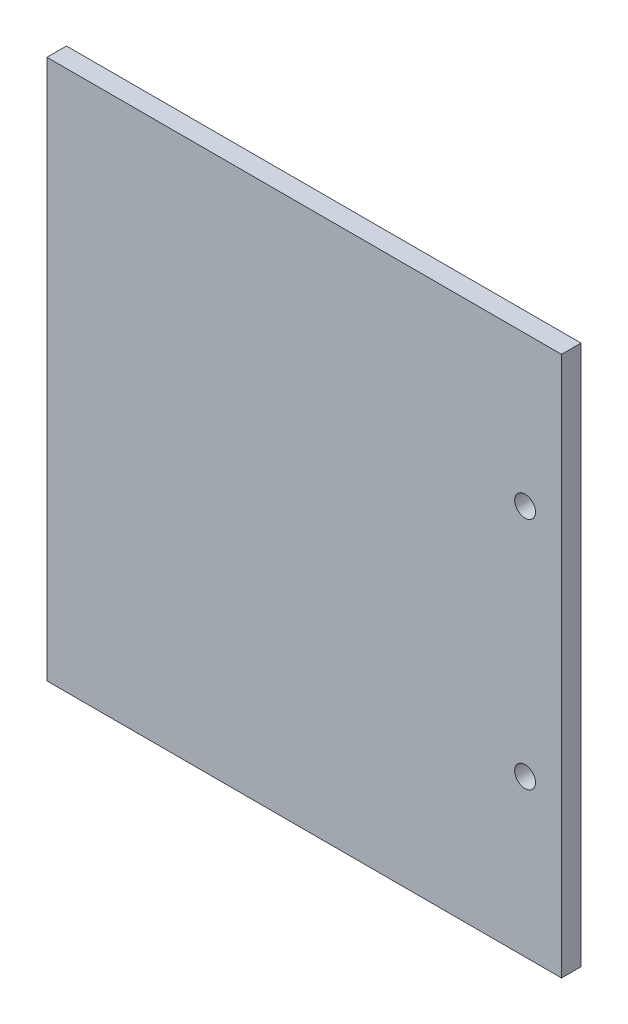
ISO-10303-21;
HEADER;
FILE_DESCRIPTION(('STEP AP214'),'2;1');
FILE_NAME('part.step','',(''),(''),'','','');
FILE_SCHEMA(('AUTOMOTIVE_DESIGN { 1 0 10303 214 1 1 1 1 }'));
ENDSEC;
DATA;
#1=APPLICATION_CONTEXT('core data for automotive mechanical design processes');
#2=APPLICATION_PROTOCOL_DEFINITION('international standard','automotive_design',2000,#1);
#3=PRODUCT_CONTEXT('',#1,'mechanical');
#4=PRODUCT('Part','Part','',(#3));
#5=PRODUCT_RELATED_PRODUCT_CATEGORY('part','',(#4));
#6=PRODUCT_DEFINITION_FORMATION('','',#4);
#7=PRODUCT_DEFINITION_CONTEXT('part definition',#1,'design');
#8=PRODUCT_DEFINITION('design','',#6,#7);
#9=PRODUCT_DEFINITION_SHAPE('','',#8);
#10=(LENGTH_UNIT() NAMED_UNIT(*) SI_UNIT(.MILLI.,.METRE.));
#11=(NAMED_UNIT(*) PLANE_ANGLE_UNIT() SI_UNIT($,.RADIAN.));
#12=(NAMED_UNIT(*) SI_UNIT($,.STERADIAN.) SOLID_ANGLE_UNIT());
#13=UNCERTAINTY_MEASURE_WITH_UNIT(LENGTH_MEASURE(1.E-05),#10,'distance_accuracy_value','');
#14=(GEOMETRIC_REPRESENTATION_CONTEXT(3) GLOBAL_UNCERTAINTY_ASSIGNED_CONTEXT((#13)) GLOBAL_UNIT_ASSIGNED_CONTEXT((#10,
#11,#12)) REPRESENTATION_CONTEXT('',''));
#15=CARTESIAN_POINT('',(0.,0.,0.));
#16=DIRECTION('',(0.,0.,1.));
#17=DIRECTION('',(1.,0.,0.));
#18=AXIS2_PLACEMENT_3D('',#15,#16,#17);
#19=CARTESIAN_POINT('',(0.,0.,4.7625));
#20=DIRECTION('',(0.,0.,-1.));
#21=DIRECTION('',(-1.,0.,0.));
#22=AXIS2_PLACEMENT_3D('',#19,#20,#21);
#23=PLANE('',#22);
#24=CARTESIAN_POINT('',(133.35,38.1,4.7625));
#25=DIRECTION('',(0.,0.,1.));
#26=DIRECTION('',(1.,0.,0.));
#27=AXIS2_PLACEMENT_3D('',#24,#25,#26);
#28=CIRCLE('',#27,2.53999999999998);
#29=CARTESIAN_POINT('',(135.89,38.1,4.7625));
#30=VERTEX_POINT('',#29);
#31=EDGE_CURVE('E100',#30,#30,#28,.T.);
#32=ORIENTED_EDGE('',*,*,#31,.F.);
#33=EDGE_LOOP('',(#32));
#34=FACE_BOUND('',#33,.T.);
#35=DIRECTION('',(0.,-1.,0.));
#36=VECTOR('',#35,1.);
#37=CARTESIAN_POINT('',(16.697999878,0.,4.7625));
#38=LINE('',#37,#36);
#39=CARTESIAN_POINT('',(16.697999878,131.7625,4.7625));
#40=VERTEX_POINT('',#39);
#41=CARTESIAN_POINT('',(16.697999878,0.,4.7625));
#42=VERTEX_POINT('',#41);
#43=EDGE_CURVE('E85',#40,#42,#38,.T.);
#44=ORIENTED_EDGE('',*,*,#43,.T.);
#45=DIRECTION('',(1.,0.,0.));
#46=VECTOR('',#45,1.);
#47=CARTESIAN_POINT('',(16.697999878,0.,4.7625));
#48=LINE('',#47,#46);
#49=CARTESIAN_POINT('',(142.24,0.,4.7625));
#50=VERTEX_POINT('',#49);
#51=EDGE_CURVE('E80',#42,#50,#48,.T.);
#52=ORIENTED_EDGE('',*,*,#51,.T.);
#53=DIRECTION('',(0.,1.,0.));
#54=VECTOR('',#53,1.);
#55=CARTESIAN_POINT('',(142.24,0.,4.7625));
#56=LINE('',#55,#54);
#57=CARTESIAN_POINT('',(142.24,131.7625,4.7625));
#58=VERTEX_POINT('',#57);
#59=EDGE_CURVE('E83',#50,#58,#56,.T.);
#60=ORIENTED_EDGE('',*,*,#59,.T.);
#61=DIRECTION('',(-1.,0.,0.));
#62=VECTOR('',#61,1.);
#63=CARTESIAN_POINT('',(16.697999878,131.7625,4.7625));
#64=LINE('',#63,#62);
#65=EDGE_CURVE('E50',#58,#40,#64,.T.);
#66=ORIENTED_EDGE('',*,*,#65,.T.);
#67=EDGE_LOOP('',(#44,#52,#60,#66));
#68=FACE_BOUND('',#67,.T.);
#69=CARTESIAN_POINT('',(133.35,95.25,4.7625));
#70=DIRECTION('',(0.,0.,1.));
#71=DIRECTION('',(1.,0.,0.));
#72=AXIS2_PLACEMENT_3D('',#69,#70,#71);
#73=CIRCLE('',#72,2.53999999999998);
#74=CARTESIAN_POINT('',(135.89,95.25,4.7625));
#75=VERTEX_POINT('',#74);
#76=EDGE_CURVE('E115',#75,#75,#73,.T.);
#77=ORIENTED_EDGE('',*,*,#76,.F.);
#78=EDGE_LOOP('',(#77));
#79=FACE_BOUND('',#78,.T.);
#80=ADVANCED_FACE('F33',(#34,#68,#79),#23,.F.);
#81=CARTESIAN_POINT('',(0.,0.,0.));
#82=DIRECTION('',(0.,0.,-1.));
#83=DIRECTION('',(-1.,0.,0.));
#84=AXIS2_PLACEMENT_3D('',#81,#82,#83);
#85=PLANE('',#84);
#86=CARTESIAN_POINT('',(133.35,38.1,0.));
#87=DIRECTION('',(0.,0.,1.));
#88=DIRECTION('',(1.,0.,0.));
#89=AXIS2_PLACEMENT_3D('',#86,#87,#88);
#90=CIRCLE('',#89,2.53999999999998);
#91=CARTESIAN_POINT('',(135.89,38.1,0.));
#92=VERTEX_POINT('',#91);
#93=EDGE_CURVE('E112',#92,#92,#90,.T.);
#94=ORIENTED_EDGE('',*,*,#93,.T.);
#95=EDGE_LOOP('',(#94));
#96=FACE_BOUND('',#95,.T.);
#97=DIRECTION('',(0.,-1.,0.));
#98=VECTOR('',#97,1.);
#99=CARTESIAN_POINT('',(16.697999878,0.,0.));
#100=LINE('',#99,#98);
#101=CARTESIAN_POINT('',(16.697999878,131.7625,0.));
#102=VERTEX_POINT('',#101);
#103=CARTESIAN_POINT('',(16.697999878,0.,0.));
#104=VERTEX_POINT('',#103);
#105=EDGE_CURVE('E97',#102,#104,#100,.T.);
#106=ORIENTED_EDGE('',*,*,#105,.F.);
#107=DIRECTION('',(-1.,0.,0.));
#108=VECTOR('',#107,1.);
#109=CARTESIAN_POINT('',(16.697999878,131.7625,0.));
#110=LINE('',#109,#108);
#111=CARTESIAN_POINT('',(142.24,131.7625,0.));
#112=VERTEX_POINT('',#111);
#113=EDGE_CURVE('E73',#112,#102,#110,.T.);
#114=ORIENTED_EDGE('',*,*,#113,.F.);
#115=DIRECTION('',(0.,1.,0.));
#116=VECTOR('',#115,1.);
#117=CARTESIAN_POINT('',(142.24,0.,0.));
#118=LINE('',#117,#116);
#119=CARTESIAN_POINT('',(142.24,0.,0.));
#120=VERTEX_POINT('',#119);
#121=EDGE_CURVE('E67',#120,#112,#118,.T.);
#122=ORIENTED_EDGE('',*,*,#121,.F.);
#123=DIRECTION('',(1.,0.,0.));
#124=VECTOR('',#123,1.);
#125=CARTESIAN_POINT('',(16.697999878,0.,0.));
#126=LINE('',#125,#124);
#127=EDGE_CURVE('E89',#104,#120,#126,.T.);
#128=ORIENTED_EDGE('',*,*,#127,.F.);
#129=EDGE_LOOP('',(#106,#114,#122,#128));
#130=FACE_BOUND('',#129,.T.);
#131=CARTESIAN_POINT('',(133.35,95.25,0.));
#132=DIRECTION('',(0.,0.,1.));
#133=DIRECTION('',(1.,0.,0.));
#134=AXIS2_PLACEMENT_3D('',#131,#132,#133);
#135=CIRCLE('',#134,2.53999999999998);
#136=CARTESIAN_POINT('',(135.89,95.25,0.));
#137=VERTEX_POINT('',#136);
#138=EDGE_CURVE('E118',#137,#137,#135,.T.);
#139=ORIENTED_EDGE('',*,*,#138,.T.);
#140=EDGE_LOOP('',(#139));
#141=FACE_BOUND('',#140,.T.);
#142=ADVANCED_FACE('F108',(#96,#130,#141),#85,.T.);
#143=CARTESIAN_POINT('',(16.697999878,0.,4.7625));
#144=DIRECTION('',(1.,0.,0.));
#145=DIRECTION('',(0.,0.,-1.));
#146=AXIS2_PLACEMENT_3D('',#143,#144,#145);
#147=PLANE('',#146);
#148=ORIENTED_EDGE('',*,*,#105,.T.);
#149=DIRECTION('',(0.,0.,-1.));
#150=VECTOR('',#149,1.);
#151=CARTESIAN_POINT('',(16.697999878,0.,4.7625));
#152=LINE('',#151,#150);
#153=EDGE_CURVE('E11',#42,#104,#152,.T.);
#154=ORIENTED_EDGE('',*,*,#153,.F.);
#155=ORIENTED_EDGE('',*,*,#43,.F.);
#156=DIRECTION('',(0.,0.,-1.));
#157=VECTOR('',#156,1.);
#158=CARTESIAN_POINT('',(16.697999878,131.7625,4.7625));
#159=LINE('',#158,#157);
#160=EDGE_CURVE('E93',#40,#102,#159,.T.);
#161=ORIENTED_EDGE('',*,*,#160,.T.);
#162=EDGE_LOOP('',(#148,#154,#155,#161));
#163=FACE_BOUND('',#162,.T.);
#164=ADVANCED_FACE('F35',(#163),#147,.F.);
#165=CARTESIAN_POINT('',(16.697999878,0.,4.7625));
#166=DIRECTION('',(0.,1.,0.));
#167=DIRECTION('',(0.,0.,1.));
#168=AXIS2_PLACEMENT_3D('',#165,#166,#167);
#169=PLANE('',#168);
#170=ORIENTED_EDGE('',*,*,#127,.T.);
#171=DIRECTION('',(0.,0.,-1.));
#172=VECTOR('',#171,1.);
#173=CARTESIAN_POINT('',(142.24,0.,4.7625));
#174=LINE('',#173,#172);
#175=EDGE_CURVE('E42',#50,#120,#174,.T.);
#176=ORIENTED_EDGE('',*,*,#175,.F.);
#177=ORIENTED_EDGE('',*,*,#51,.F.);
#178=ORIENTED_EDGE('',*,*,#153,.T.);
#179=EDGE_LOOP('',(#170,#176,#177,#178));
#180=FACE_BOUND('',#179,.T.);
#181=ADVANCED_FACE('F88',(#180),#169,.F.);
#182=CARTESIAN_POINT('',(142.24,0.,4.7625));
#183=DIRECTION('',(-1.,0.,0.));
#184=DIRECTION('',(0.,0.,1.));
#185=AXIS2_PLACEMENT_3D('',#182,#183,#184);
#186=PLANE('',#185);
#187=ORIENTED_EDGE('',*,*,#121,.T.);
#188=DIRECTION('',(0.,0.,-1.));
#189=VECTOR('',#188,1.);
#190=CARTESIAN_POINT('',(142.24,131.7625,4.7625));
#191=LINE('',#190,#189);
#192=EDGE_CURVE('E90',#58,#112,#191,.T.);
#193=ORIENTED_EDGE('',*,*,#192,.F.);
#194=ORIENTED_EDGE('',*,*,#59,.F.);
#195=ORIENTED_EDGE('',*,*,#175,.T.);
#196=EDGE_LOOP('',(#187,#193,#194,#195));
#197=FACE_BOUND('',#196,.T.);
#198=ADVANCED_FACE('F91',(#197),#186,.F.);
#199=CARTESIAN_POINT('',(16.697999878,131.7625,4.7625));
#200=DIRECTION('',(0.,-1.,0.));
#201=DIRECTION('',(0.,0.,-1.));
#202=AXIS2_PLACEMENT_3D('',#199,#200,#201);
#203=PLANE('',#202);
#204=ORIENTED_EDGE('',*,*,#113,.T.);
#205=ORIENTED_EDGE('',*,*,#160,.F.);
#206=ORIENTED_EDGE('',*,*,#65,.F.);
#207=ORIENTED_EDGE('',*,*,#192,.T.);
#208=EDGE_LOOP('',(#204,#205,#206,#207));
#209=FACE_BOUND('',#208,.T.);
#210=ADVANCED_FACE('F105',(#209),#203,.F.);
#211=CARTESIAN_POINT('',(133.35,38.1,4.7625));
#212=DIRECTION('',(0.,0.,-1.));
#213=DIRECTION('',(-1.,0.,0.));
#214=AXIS2_PLACEMENT_3D('',#211,#212,#213);
#215=CYLINDRICAL_SURFACE('',#214,2.53999999999998);
#216=ORIENTED_EDGE('',*,*,#31,.T.);
#217=EDGE_LOOP('',(#216));
#218=FACE_BOUND('',#217,.T.);
#219=ORIENTED_EDGE('',*,*,#93,.F.);
#220=EDGE_LOOP('',(#219));
#221=FACE_BOUND('',#220,.T.);
#222=ADVANCED_FACE('F136',(#218,#221),#215,.F.);
#223=CARTESIAN_POINT('',(133.35,95.25,4.7625));
#224=DIRECTION('',(0.,0.,-1.));
#225=DIRECTION('',(-1.,0.,0.));
#226=AXIS2_PLACEMENT_3D('',#223,#224,#225);
#227=CYLINDRICAL_SURFACE('',#226,2.53999999999998);
#228=ORIENTED_EDGE('',*,*,#76,.T.);
#229=EDGE_LOOP('',(#228));
#230=FACE_BOUND('',#229,.T.);
#231=ORIENTED_EDGE('',*,*,#138,.F.);
#232=EDGE_LOOP('',(#231));
#233=FACE_BOUND('',#232,.T.);
#234=ADVANCED_FACE('F124',(#230,#233),#227,.F.);
#235=CLOSED_SHELL('',(#80,#142,#164,#181,#198,#210,#222,#234));
#236=MANIFOLD_SOLID_BREP('B2',#235);
#237=ADVANCED_BREP_SHAPE_REPRESENTATION('',(#18,#236),#14);
#238=SHAPE_DEFINITION_REPRESENTATION(#9,#237);
ENDSEC;
END-ISO-10303-21;
